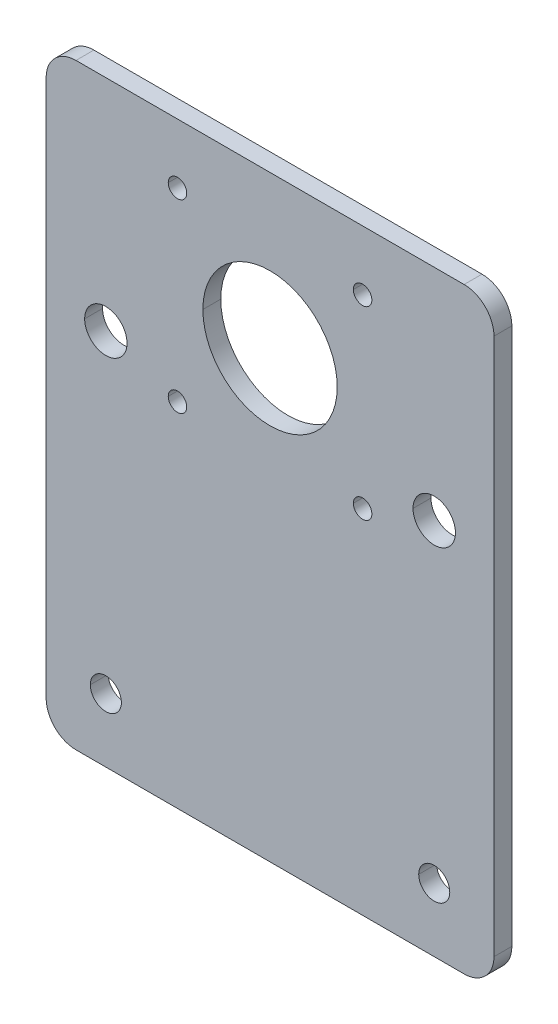
ISO-10303-21;
HEADER;
FILE_DESCRIPTION(('STEP AP214'),'2;1');
FILE_NAME('part.step','',(''),(''),'','','');
FILE_SCHEMA(('AUTOMOTIVE_DESIGN { 1 0 10303 214 1 1 1 1 }'));
ENDSEC;
DATA;
#1=APPLICATION_CONTEXT('core data for automotive mechanical design processes');
#2=APPLICATION_PROTOCOL_DEFINITION('international standard','automotive_design',2000,#1);
#3=PRODUCT_CONTEXT('',#1,'mechanical');
#4=PRODUCT('Part','Part','',(#3));
#5=PRODUCT_RELATED_PRODUCT_CATEGORY('part','',(#4));
#6=PRODUCT_DEFINITION_FORMATION('','',#4);
#7=PRODUCT_DEFINITION_CONTEXT('part definition',#1,'design');
#8=PRODUCT_DEFINITION('design','',#6,#7);
#9=PRODUCT_DEFINITION_SHAPE('','',#8);
#10=(LENGTH_UNIT() NAMED_UNIT(*) SI_UNIT(.MILLI.,.METRE.));
#11=(NAMED_UNIT(*) PLANE_ANGLE_UNIT() SI_UNIT($,.RADIAN.));
#12=(NAMED_UNIT(*) SI_UNIT($,.STERADIAN.) SOLID_ANGLE_UNIT());
#13=UNCERTAINTY_MEASURE_WITH_UNIT(LENGTH_MEASURE(1.E-05),#10,'distance_accuracy_value','');
#14=(GEOMETRIC_REPRESENTATION_CONTEXT(3) GLOBAL_UNCERTAINTY_ASSIGNED_CONTEXT((#13)) GLOBAL_UNIT_ASSIGNED_CONTEXT((#10,
#11,#12)) REPRESENTATION_CONTEXT('',''));
#15=CARTESIAN_POINT('',(0.,0.,0.));
#16=DIRECTION('',(0.,0.,1.));
#17=DIRECTION('',(1.,0.,0.));
#18=AXIS2_PLACEMENT_3D('',#15,#16,#17);
#19=CARTESIAN_POINT('',(40.,-75.7250966848653,3.));
#20=DIRECTION('',(0.,0.,-1.));
#21=DIRECTION('',(-1.,0.,0.));
#22=AXIS2_PLACEMENT_3D('',#19,#20,#21);
#23=CYLINDRICAL_SURFACE('',#22,5.);
#24=CARTESIAN_POINT('',(40.,-75.7250966848653,3.));
#25=DIRECTION('',(0.,0.,1.));
#26=DIRECTION('',(-1.,0.,0.));
#27=AXIS2_PLACEMENT_3D('',#24,#25,#26);
#28=CIRCLE('',#27,5.);
#29=CARTESIAN_POINT('',(40.,-80.7250966848653,3.));
#30=VERTEX_POINT('',#29);
#31=CARTESIAN_POINT('',(45.,-75.7250966848653,3.));
#32=VERTEX_POINT('',#31);
#33=EDGE_CURVE('E536',#30,#32,#28,.T.);
#34=ORIENTED_EDGE('',*,*,#33,.F.);
#35=DIRECTION('',(0.,0.,1.));
#36=VECTOR('',#35,1.);
#37=CARTESIAN_POINT('',(40.,-80.7250966848653,10.));
#38=LINE('',#37,#36);
#39=CARTESIAN_POINT('',(40.,-80.7250966848653,0.));
#40=VERTEX_POINT('',#39);
#41=EDGE_CURVE('E11',#40,#30,#38,.T.);
#42=ORIENTED_EDGE('',*,*,#41,.F.);
#43=CARTESIAN_POINT('',(40.,-75.7250966848653,0.));
#44=DIRECTION('',(0.,0.,-1.));
#45=DIRECTION('',(-1.,0.,0.));
#46=AXIS2_PLACEMENT_3D('',#43,#44,#45);
#47=CIRCLE('',#46,5.);
#48=CARTESIAN_POINT('',(45.,-75.7250966848653,0.));
#49=VERTEX_POINT('',#48);
#50=EDGE_CURVE('E424',#49,#40,#47,.T.);
#51=ORIENTED_EDGE('',*,*,#50,.F.);
#52=DIRECTION('',(0.,0.,-1.));
#53=VECTOR('',#52,1.);
#54=CARTESIAN_POINT('',(45.,-75.7250966848653,3.));
#55=LINE('',#54,#53);
#56=EDGE_CURVE('E451',#32,#49,#55,.T.);
#57=ORIENTED_EDGE('',*,*,#56,.F.);
#58=EDGE_LOOP('',(#34,#42,#51,#57));
#59=FACE_BOUND('',#58,.T.);
#60=ADVANCED_FACE('F17',(#59),#23,.T.);
#61=CARTESIAN_POINT('',(-25.,-75.7250966848653,10.));
#62=DIRECTION('',(0.,0.,-1.));
#63=DIRECTION('',(-1.,0.,0.));
#64=AXIS2_PLACEMENT_3D('',#61,#62,#63);
#65=CYLINDRICAL_SURFACE('',#64,5.);
#66=CARTESIAN_POINT('',(-25.,-75.7250966848653,3.));
#67=DIRECTION('',(0.,0.,1.));
#68=DIRECTION('',(-1.,0.,0.));
#69=AXIS2_PLACEMENT_3D('',#66,#67,#68);
#70=CIRCLE('',#69,5.);
#71=CARTESIAN_POINT('',(-30.,-75.7250966848653,3.));
#72=VERTEX_POINT('',#71);
#73=CARTESIAN_POINT('',(-25.,-80.7250966848653,3.));
#74=VERTEX_POINT('',#73);
#75=EDGE_CURVE('E528',#72,#74,#70,.T.);
#76=ORIENTED_EDGE('',*,*,#75,.F.);
#77=DIRECTION('',(0.,0.,1.));
#78=VECTOR('',#77,1.);
#79=CARTESIAN_POINT('',(-30.,-75.7250966848653,3.));
#80=LINE('',#79,#78);
#81=CARTESIAN_POINT('',(-30.,-75.7250966848653,0.));
#82=VERTEX_POINT('',#81);
#83=EDGE_CURVE('E347',#82,#72,#80,.T.);
#84=ORIENTED_EDGE('',*,*,#83,.F.);
#85=CARTESIAN_POINT('',(-25.,-75.7250966848653,0.));
#86=DIRECTION('',(0.,0.,-1.));
#87=DIRECTION('',(-1.,0.,0.));
#88=AXIS2_PLACEMENT_3D('',#85,#86,#87);
#89=CIRCLE('',#88,5.);
#90=CARTESIAN_POINT('',(-25.,-80.7250966848653,0.));
#91=VERTEX_POINT('',#90);
#92=EDGE_CURVE('E412',#91,#82,#89,.T.);
#93=ORIENTED_EDGE('',*,*,#92,.F.);
#94=DIRECTION('',(0.,0.,-1.));
#95=VECTOR('',#94,1.);
#96=CARTESIAN_POINT('',(-25.,-80.7250966848653,10.));
#97=LINE('',#96,#95);
#98=EDGE_CURVE('E25',#74,#91,#97,.T.);
#99=ORIENTED_EDGE('',*,*,#98,.F.);
#100=EDGE_LOOP('',(#76,#84,#93,#99));
#101=FACE_BOUND('',#100,.T.);
#102=ADVANCED_FACE('F543',(#101),#65,.T.);
#103=CARTESIAN_POINT('',(45.,-80.7250966848653,10.));
#104=DIRECTION('',(0.,1.,0.));
#105=DIRECTION('',(1.,0.,0.));
#106=AXIS2_PLACEMENT_3D('',#103,#104,#105);
#107=PLANE('',#106);
#108=DIRECTION('',(1.,0.,0.));
#109=VECTOR('',#108,1.);
#110=CARTESIAN_POINT('',(0.,-80.7250966848653,3.));
#111=LINE('',#110,#109);
#112=EDGE_CURVE('E532',#74,#30,#111,.T.);
#113=ORIENTED_EDGE('',*,*,#112,.F.);
#114=ORIENTED_EDGE('',*,*,#98,.T.);
#115=DIRECTION('',(1.,0.,0.));
#116=VECTOR('',#115,1.);
#117=CARTESIAN_POINT('',(45.,-80.7250966848653,0.));
#118=LINE('',#117,#116);
#119=EDGE_CURVE('E417',#91,#40,#118,.T.);
#120=ORIENTED_EDGE('',*,*,#119,.T.);
#121=ORIENTED_EDGE('',*,*,#41,.T.);
#122=EDGE_LOOP('',(#113,#114,#120,#121));
#123=FACE_BOUND('',#122,.T.);
#124=ADVANCED_FACE('F541',(#123),#107,.F.);
#125=CARTESIAN_POINT('',(0.,0.,3.));
#126=DIRECTION('',(0.,0.,-1.));
#127=DIRECTION('',(0.,-1.,0.));
#128=AXIS2_PLACEMENT_3D('',#125,#126,#127);
#129=PLANE('',#128);
#130=CARTESIAN_POINT('',(23.,9.27490331513474,3.));
#131=DIRECTION('',(0.,0.,-1.));
#132=DIRECTION('',(-1.,0.,0.));
#133=AXIS2_PLACEMENT_3D('',#130,#131,#132);
#134=CIRCLE('',#133,1.55);
#135=CARTESIAN_POINT('',(21.45,9.27490331513474,3.));
#136=VERTEX_POINT('',#135);
#137=CARTESIAN_POINT('',(24.55,9.27490331513474,3.));
#138=VERTEX_POINT('',#137);
#139=EDGE_CURVE('E525',#136,#138,#134,.T.);
#140=ORIENTED_EDGE('',*,*,#139,.T.);
#141=CARTESIAN_POINT('',(23.,9.27490331513474,3.));
#142=DIRECTION('',(0.,0.,-1.));
#143=DIRECTION('',(-1.,0.,0.));
#144=AXIS2_PLACEMENT_3D('',#141,#142,#143);
#145=CIRCLE('',#144,1.55);
#146=EDGE_CURVE('E336',#138,#136,#145,.T.);
#147=ORIENTED_EDGE('',*,*,#146,.T.);
#148=EDGE_LOOP('',(#140,#147));
#149=FACE_BOUND('',#148,.T.);
#150=CARTESIAN_POINT('',(-8.,-21.7250966848652,3.));
#151=DIRECTION('',(0.,0.,-1.));
#152=DIRECTION('',(-1.,0.,0.));
#153=AXIS2_PLACEMENT_3D('',#150,#151,#152);
#154=CIRCLE('',#153,1.55);
#155=CARTESIAN_POINT('',(-9.55,-21.7250966848652,3.));
#156=VERTEX_POINT('',#155);
#157=CARTESIAN_POINT('',(-6.45,-21.7250966848652,3.));
#158=VERTEX_POINT('',#157);
#159=EDGE_CURVE('E489',#156,#158,#154,.T.);
#160=ORIENTED_EDGE('',*,*,#159,.T.);
#161=CARTESIAN_POINT('',(-8.,-21.7250966848652,3.));
#162=DIRECTION('',(0.,0.,-1.));
#163=DIRECTION('',(-1.,0.,0.));
#164=AXIS2_PLACEMENT_3D('',#161,#162,#163);
#165=CIRCLE('',#164,1.55);
#166=EDGE_CURVE('E395',#158,#156,#165,.T.);
#167=ORIENTED_EDGE('',*,*,#166,.T.);
#168=EDGE_LOOP('',(#160,#167));
#169=FACE_BOUND('',#168,.T.);
#170=CARTESIAN_POINT('',(35.,-17.4750966848652,3.));
#171=DIRECTION('',(0.,0.,-1.));
#172=DIRECTION('',(-1.,0.,0.));
#173=AXIS2_PLACEMENT_3D('',#170,#171,#172);
#174=CIRCLE('',#173,3.55);
#175=CARTESIAN_POINT('',(31.45,-17.4750966848652,3.));
#176=VERTEX_POINT('',#175);
#177=CARTESIAN_POINT('',(38.55,-17.4750966848652,3.));
#178=VERTEX_POINT('',#177);
#179=EDGE_CURVE('E486',#176,#178,#174,.T.);
#180=ORIENTED_EDGE('',*,*,#179,.T.);
#181=CARTESIAN_POINT('',(35.,-17.4750966848652,3.));
#182=DIRECTION('',(0.,0.,-1.));
#183=DIRECTION('',(-1.,0.,0.));
#184=AXIS2_PLACEMENT_3D('',#181,#182,#183);
#185=CIRCLE('',#184,3.55);
#186=EDGE_CURVE('E311',#178,#176,#185,.T.);
#187=ORIENTED_EDGE('',*,*,#186,.T.);
#188=EDGE_LOOP('',(#180,#187));
#189=FACE_BOUND('',#188,.T.);
#190=CARTESIAN_POINT('',(35.,-70.0750966848653,3.));
#191=DIRECTION('',(0.,0.,-1.));
#192=DIRECTION('',(-1.,0.,0.));
#193=AXIS2_PLACEMENT_3D('',#190,#191,#192);
#194=CIRCLE('',#193,2.6);
#195=CARTESIAN_POINT('',(32.4,-70.0750966848653,3.));
#196=VERTEX_POINT('',#195);
#197=CARTESIAN_POINT('',(37.6,-70.0750966848653,3.));
#198=VERTEX_POINT('',#197);
#199=EDGE_CURVE('E490',#196,#198,#194,.T.);
#200=ORIENTED_EDGE('',*,*,#199,.T.);
#201=CARTESIAN_POINT('',(35.,-70.0750966848653,3.));
#202=DIRECTION('',(0.,0.,-1.));
#203=DIRECTION('',(-1.,0.,0.));
#204=AXIS2_PLACEMENT_3D('',#201,#202,#203);
#205=CIRCLE('',#204,2.6);
#206=EDGE_CURVE('E369',#198,#196,#205,.T.);
#207=ORIENTED_EDGE('',*,*,#206,.T.);
#208=EDGE_LOOP('',(#200,#207));
#209=FACE_BOUND('',#208,.T.);
#210=CARTESIAN_POINT('',(-20.,-70.0750966848653,3.));
#211=DIRECTION('',(0.,0.,-1.));
#212=DIRECTION('',(-1.,0.,0.));
#213=AXIS2_PLACEMENT_3D('',#210,#211,#212);
#214=CIRCLE('',#213,2.6);
#215=CARTESIAN_POINT('',(-22.6,-70.0750966848653,3.));
#216=VERTEX_POINT('',#215);
#217=CARTESIAN_POINT('',(-17.4,-70.0750966848653,3.));
#218=VERTEX_POINT('',#217);
#219=EDGE_CURVE('E503',#216,#218,#214,.T.);
#220=ORIENTED_EDGE('',*,*,#219,.T.);
#221=CARTESIAN_POINT('',(-20.,-70.0750966848653,3.));
#222=DIRECTION('',(0.,0.,-1.));
#223=DIRECTION('',(-1.,0.,0.));
#224=AXIS2_PLACEMENT_3D('',#221,#222,#223);
#225=CIRCLE('',#224,2.6);
#226=EDGE_CURVE('E298',#218,#216,#225,.T.);
#227=ORIENTED_EDGE('',*,*,#226,.T.);
#228=EDGE_LOOP('',(#220,#227));
#229=FACE_BOUND('',#228,.T.);
#230=CARTESIAN_POINT('',(-20.,-17.4750966848652,3.));
#231=DIRECTION('',(0.,0.,-1.));
#232=DIRECTION('',(-1.,0.,0.));
#233=AXIS2_PLACEMENT_3D('',#230,#231,#232);
#234=CIRCLE('',#233,3.55);
#235=CARTESIAN_POINT('',(-23.55,-17.4750966848652,3.));
#236=VERTEX_POINT('',#235);
#237=CARTESIAN_POINT('',(-16.45,-17.4750966848652,3.));
#238=VERTEX_POINT('',#237);
#239=EDGE_CURVE('E459',#236,#238,#234,.T.);
#240=ORIENTED_EDGE('',*,*,#239,.T.);
#241=CARTESIAN_POINT('',(-20.,-17.4750966848652,3.));
#242=DIRECTION('',(0.,0.,-1.));
#243=DIRECTION('',(-1.,0.,0.));
#244=AXIS2_PLACEMENT_3D('',#241,#242,#243);
#245=CIRCLE('',#244,3.55);
#246=EDGE_CURVE('E306',#238,#236,#245,.T.);
#247=ORIENTED_EDGE('',*,*,#246,.T.);
#248=EDGE_LOOP('',(#240,#247));
#249=FACE_BOUND('',#248,.T.);
#250=CARTESIAN_POINT('',(-8.,9.27490331513474,3.));
#251=DIRECTION('',(0.,0.,-1.));
#252=DIRECTION('',(-1.,0.,0.));
#253=AXIS2_PLACEMENT_3D('',#250,#251,#252);
#254=CIRCLE('',#253,1.55);
#255=CARTESIAN_POINT('',(-9.55,9.27490331513474,3.));
#256=VERTEX_POINT('',#255);
#257=CARTESIAN_POINT('',(-6.45,9.27490331513474,3.));
#258=VERTEX_POINT('',#257);
#259=EDGE_CURVE('E456',#256,#258,#254,.T.);
#260=ORIENTED_EDGE('',*,*,#259,.T.);
#261=CARTESIAN_POINT('',(-8.,9.27490331513474,3.));
#262=DIRECTION('',(0.,0.,-1.));
#263=DIRECTION('',(-1.,0.,0.));
#264=AXIS2_PLACEMENT_3D('',#261,#262,#263);
#265=CIRCLE('',#264,1.55);
#266=EDGE_CURVE('E327',#258,#256,#265,.T.);
#267=ORIENTED_EDGE('',*,*,#266,.T.);
#268=EDGE_LOOP('',(#260,#267));
#269=FACE_BOUND('',#268,.T.);
#270=CARTESIAN_POINT('',(23.,-21.7250966848652,3.));
#271=DIRECTION('',(0.,0.,-1.));
#272=DIRECTION('',(-1.,0.,0.));
#273=AXIS2_PLACEMENT_3D('',#270,#271,#272);
#274=CIRCLE('',#273,1.55);
#275=CARTESIAN_POINT('',(21.45,-21.7250966848652,3.));
#276=VERTEX_POINT('',#275);
#277=CARTESIAN_POINT('',(24.55,-21.7250966848652,3.));
#278=VERTEX_POINT('',#277);
#279=EDGE_CURVE('E257',#276,#278,#274,.T.);
#280=ORIENTED_EDGE('',*,*,#279,.T.);
#281=CARTESIAN_POINT('',(23.,-21.7250966848652,3.));
#282=DIRECTION('',(0.,0.,-1.));
#283=DIRECTION('',(-1.,0.,0.));
#284=AXIS2_PLACEMENT_3D('',#281,#282,#283);
#285=CIRCLE('',#284,1.55);
#286=EDGE_CURVE('E294',#278,#276,#285,.T.);
#287=ORIENTED_EDGE('',*,*,#286,.T.);
#288=EDGE_LOOP('',(#280,#287));
#289=FACE_BOUND('',#288,.T.);
#290=CARTESIAN_POINT('',(7.5,-6.22509668486526,3.));
#291=DIRECTION('',(0.,0.,-1.));
#292=DIRECTION('',(-1.,0.,0.));
#293=AXIS2_PLACEMENT_3D('',#290,#291,#292);
#294=CIRCLE('',#293,11.25);
#295=CARTESIAN_POINT('',(-3.75,-6.22509668486526,3.));
#296=VERTEX_POINT('',#295);
#297=CARTESIAN_POINT('',(18.75,-6.22509668486526,3.));
#298=VERTEX_POINT('',#297);
#299=EDGE_CURVE('E247',#296,#298,#294,.T.);
#300=ORIENTED_EDGE('',*,*,#299,.T.);
#301=CARTESIAN_POINT('',(7.5,-6.22509668486526,3.));
#302=DIRECTION('',(0.,0.,-1.));
#303=DIRECTION('',(-1.,0.,0.));
#304=AXIS2_PLACEMENT_3D('',#301,#302,#303);
#305=CIRCLE('',#304,11.25);
#306=EDGE_CURVE('E252',#298,#296,#305,.T.);
#307=ORIENTED_EDGE('',*,*,#306,.T.);
#308=EDGE_LOOP('',(#300,#307));
#309=FACE_BOUND('',#308,.T.);
#310=DIRECTION('',(0.,-1.,0.));
#311=VECTOR('',#310,1.);
#312=CARTESIAN_POINT('',(-30.,-105.819408872504,3.));
#313=LINE('',#312,#311);
#314=CARTESIAN_POINT('',(-30.,14.2749033151347,3.));
#315=VERTEX_POINT('',#314);
#316=EDGE_CURVE('E351',#315,#72,#313,.T.);
#317=ORIENTED_EDGE('',*,*,#316,.T.);
#318=ORIENTED_EDGE('',*,*,#75,.T.);
#319=ORIENTED_EDGE('',*,*,#112,.T.);
#320=ORIENTED_EDGE('',*,*,#33,.T.);
#321=DIRECTION('',(0.,1.,0.));
#322=VECTOR('',#321,1.);
#323=CARTESIAN_POINT('',(45.,-105.819408872504,3.));
#324=LINE('',#323,#322);
#325=CARTESIAN_POINT('',(45.,14.2749033151347,3.));
#326=VERTEX_POINT('',#325);
#327=EDGE_CURVE('E399',#32,#326,#324,.T.);
#328=ORIENTED_EDGE('',*,*,#327,.T.);
#329=CARTESIAN_POINT('',(40.,14.2749033151347,3.));
#330=DIRECTION('',(0.,0.,-1.));
#331=DIRECTION('',(-1.,0.,0.));
#332=AXIS2_PLACEMENT_3D('',#329,#330,#331);
#333=CIRCLE('',#332,5.);
#334=CARTESIAN_POINT('',(40.,19.2749033151348,3.));
#335=VERTEX_POINT('',#334);
#336=EDGE_CURVE('E512',#335,#326,#333,.T.);
#337=ORIENTED_EDGE('',*,*,#336,.F.);
#338=DIRECTION('',(-1.,0.,0.));
#339=VECTOR('',#338,1.);
#340=CARTESIAN_POINT('',(-30.,19.2749033151348,3.));
#341=LINE('',#340,#339);
#342=CARTESIAN_POINT('',(-25.,19.2749033151348,3.));
#343=VERTEX_POINT('',#342);
#344=EDGE_CURVE('E361',#335,#343,#341,.T.);
#345=ORIENTED_EDGE('',*,*,#344,.T.);
#346=CARTESIAN_POINT('',(-25.,14.2749033151347,3.));
#347=DIRECTION('',(0.,0.,-1.));
#348=DIRECTION('',(-1.,0.,0.));
#349=AXIS2_PLACEMENT_3D('',#346,#347,#348);
#350=CIRCLE('',#349,5.);
#351=EDGE_CURVE('E352',#315,#343,#350,.T.);
#352=ORIENTED_EDGE('',*,*,#351,.F.);
#353=EDGE_LOOP('',(#317,#318,#319,#320,#328,#337,#345,#352));
#354=FACE_BOUND('',#353,.T.);
#355=ADVANCED_FACE('F249',(#149,#169,#189,#209,#229,#249,#269,#289,#309,#354),#129,.F.);
#356=CARTESIAN_POINT('',(23.,9.27490331513474,3.));
#357=DIRECTION('',(0.,0.,-1.));
#358=DIRECTION('',(-1.,0.,0.));
#359=AXIS2_PLACEMENT_3D('',#356,#357,#358);
#360=CYLINDRICAL_SURFACE('',#359,1.55);
#361=DIRECTION('',(0.,0.,-1.));
#362=VECTOR('',#361,1.);
#363=CARTESIAN_POINT('',(24.55,9.27490331513474,3.));
#364=LINE('',#363,#362);
#365=CARTESIAN_POINT('',(24.55,9.27490331513474,0.));
#366=VERTEX_POINT('',#365);
#367=EDGE_CURVE('E331',#138,#366,#364,.T.);
#368=ORIENTED_EDGE('',*,*,#367,.F.);
#369=ORIENTED_EDGE('',*,*,#139,.F.);
#370=DIRECTION('',(0.,0.,-1.));
#371=VECTOR('',#370,1.);
#372=CARTESIAN_POINT('',(21.45,9.27490331513474,3.));
#373=LINE('',#372,#371);
#374=CARTESIAN_POINT('',(21.45,9.27490331513474,0.));
#375=VERTEX_POINT('',#374);
#376=EDGE_CURVE('E435',#136,#375,#373,.T.);
#377=ORIENTED_EDGE('',*,*,#376,.T.);
#378=CARTESIAN_POINT('',(23.,9.27490331513474,0.));
#379=DIRECTION('',(0.,0.,1.));
#380=DIRECTION('',(-1.,0.,0.));
#381=AXIS2_PLACEMENT_3D('',#378,#379,#380);
#382=CIRCLE('',#381,1.55);
#383=EDGE_CURVE('E258',#366,#375,#382,.T.);
#384=ORIENTED_EDGE('',*,*,#383,.F.);
#385=EDGE_LOOP('',(#368,#369,#377,#384));
#386=FACE_BOUND('',#385,.T.);
#387=ADVANCED_FACE('F593',(#386),#360,.F.);
#388=CARTESIAN_POINT('',(-8.,-21.7250966848652,3.));
#389=DIRECTION('',(0.,0.,-1.));
#390=DIRECTION('',(-1.,0.,0.));
#391=AXIS2_PLACEMENT_3D('',#388,#389,#390);
#392=CYLINDRICAL_SURFACE('',#391,1.55);
#393=DIRECTION('',(0.,0.,-1.));
#394=VECTOR('',#393,1.);
#395=CARTESIAN_POINT('',(-6.45,-21.7250966848652,3.));
#396=LINE('',#395,#394);
#397=CARTESIAN_POINT('',(-6.45,-21.7250966848652,0.));
#398=VERTEX_POINT('',#397);
#399=EDGE_CURVE('E403',#158,#398,#396,.T.);
#400=ORIENTED_EDGE('',*,*,#399,.F.);
#401=ORIENTED_EDGE('',*,*,#159,.F.);
#402=DIRECTION('',(0.,0.,-1.));
#403=VECTOR('',#402,1.);
#404=CARTESIAN_POINT('',(-9.55,-21.7250966848652,3.));
#405=LINE('',#404,#403);
#406=CARTESIAN_POINT('',(-9.55,-21.7250966848652,0.));
#407=VERTEX_POINT('',#406);
#408=EDGE_CURVE('E411',#156,#407,#405,.T.);
#409=ORIENTED_EDGE('',*,*,#408,.T.);
#410=CARTESIAN_POINT('',(-8.,-21.7250966848652,0.));
#411=DIRECTION('',(0.,0.,1.));
#412=DIRECTION('',(-1.,0.,0.));
#413=AXIS2_PLACEMENT_3D('',#410,#411,#412);
#414=CIRCLE('',#413,1.55);
#415=EDGE_CURVE('E439',#398,#407,#414,.T.);
#416=ORIENTED_EDGE('',*,*,#415,.F.);
#417=EDGE_LOOP('',(#400,#401,#409,#416));
#418=FACE_BOUND('',#417,.T.);
#419=ADVANCED_FACE('F597',(#418),#392,.F.);
#420=CARTESIAN_POINT('',(35.,-17.4750966848652,3.));
#421=DIRECTION('',(0.,0.,-1.));
#422=DIRECTION('',(-1.,0.,0.));
#423=AXIS2_PLACEMENT_3D('',#420,#421,#422);
#424=CYLINDRICAL_SURFACE('',#423,3.55);
#425=DIRECTION('',(0.,0.,-1.));
#426=VECTOR('',#425,1.);
#427=CARTESIAN_POINT('',(38.55,-17.4750966848652,3.));
#428=LINE('',#427,#426);
#429=CARTESIAN_POINT('',(38.55,-17.4750966848652,0.));
#430=VERTEX_POINT('',#429);
#431=EDGE_CURVE('E383',#178,#430,#428,.T.);
#432=ORIENTED_EDGE('',*,*,#431,.F.);
#433=ORIENTED_EDGE('',*,*,#179,.F.);
#434=DIRECTION('',(0.,0.,-1.));
#435=VECTOR('',#434,1.);
#436=CARTESIAN_POINT('',(31.45,-17.4750966848652,3.));
#437=LINE('',#436,#435);
#438=CARTESIAN_POINT('',(31.45,-17.4750966848652,0.));
#439=VERTEX_POINT('',#438);
#440=EDGE_CURVE('E391',#176,#439,#437,.T.);
#441=ORIENTED_EDGE('',*,*,#440,.T.);
#442=CARTESIAN_POINT('',(35.,-17.4750966848652,0.));
#443=DIRECTION('',(0.,0.,1.));
#444=DIRECTION('',(-1.,0.,0.));
#445=AXIS2_PLACEMENT_3D('',#442,#443,#444);
#446=CIRCLE('',#445,3.55);
#447=EDGE_CURVE('E442',#430,#439,#446,.T.);
#448=ORIENTED_EDGE('',*,*,#447,.F.);
#449=EDGE_LOOP('',(#432,#433,#441,#448));
#450=FACE_BOUND('',#449,.T.);
#451=ADVANCED_FACE('F578',(#450),#424,.F.);
#452=CARTESIAN_POINT('',(35.,-70.0750966848653,3.));
#453=DIRECTION('',(0.,0.,-1.));
#454=DIRECTION('',(-1.,0.,0.));
#455=AXIS2_PLACEMENT_3D('',#452,#453,#454);
#456=CYLINDRICAL_SURFACE('',#455,2.6);
#457=DIRECTION('',(0.,0.,-1.));
#458=VECTOR('',#457,1.);
#459=CARTESIAN_POINT('',(37.6,-70.0750966848653,3.));
#460=LINE('',#459,#458);
#461=CARTESIAN_POINT('',(37.6,-70.0750966848653,0.));
#462=VERTEX_POINT('',#461);
#463=EDGE_CURVE('E373',#198,#462,#460,.T.);
#464=ORIENTED_EDGE('',*,*,#463,.F.);
#465=ORIENTED_EDGE('',*,*,#199,.F.);
#466=DIRECTION('',(0.,0.,-1.));
#467=VECTOR('',#466,1.);
#468=CARTESIAN_POINT('',(32.4,-70.0750966848653,3.));
#469=LINE('',#468,#467);
#470=CARTESIAN_POINT('',(32.4,-70.0750966848653,0.));
#471=VERTEX_POINT('',#470);
#472=EDGE_CURVE('E307',#196,#471,#469,.T.);
#473=ORIENTED_EDGE('',*,*,#472,.T.);
#474=CARTESIAN_POINT('',(35.,-70.0750966848653,0.));
#475=DIRECTION('',(0.,0.,1.));
#476=DIRECTION('',(-1.,0.,0.));
#477=AXIS2_PLACEMENT_3D('',#474,#475,#476);
#478=CIRCLE('',#477,2.6);
#479=EDGE_CURVE('E485',#462,#471,#478,.T.);
#480=ORIENTED_EDGE('',*,*,#479,.F.);
#481=EDGE_LOOP('',(#464,#465,#473,#480));
#482=FACE_BOUND('',#481,.T.);
#483=ADVANCED_FACE('F570',(#482),#456,.F.);
#484=CARTESIAN_POINT('',(45.,-105.819408872504,3.));
#485=DIRECTION('',(-1.,0.,0.));
#486=DIRECTION('',(0.,0.,1.));
#487=AXIS2_PLACEMENT_3D('',#484,#485,#486);
#488=PLANE('',#487);
#489=ORIENTED_EDGE('',*,*,#327,.F.);
#490=ORIENTED_EDGE('',*,*,#56,.T.);
#491=DIRECTION('',(0.,-1.,0.));
#492=VECTOR('',#491,1.);
#493=CARTESIAN_POINT('',(45.,0.,0.));
#494=LINE('',#493,#492);
#495=CARTESIAN_POINT('',(45.,14.2749033151347,0.));
#496=VERTEX_POINT('',#495);
#497=EDGE_CURVE('E467',#496,#49,#494,.T.);
#498=ORIENTED_EDGE('',*,*,#497,.F.);
#499=DIRECTION('',(0.,0.,-1.));
#500=VECTOR('',#499,1.);
#501=CARTESIAN_POINT('',(45.,14.2749033151347,3.));
#502=LINE('',#501,#500);
#503=EDGE_CURVE('E431',#326,#496,#502,.T.);
#504=ORIENTED_EDGE('',*,*,#503,.F.);
#505=EDGE_LOOP('',(#489,#490,#498,#504));
#506=FACE_BOUND('',#505,.T.);
#507=ADVANCED_FACE('F568',(#506),#488,.F.);
#508=CARTESIAN_POINT('',(-30.,-105.819408872504,3.));
#509=DIRECTION('',(1.,0.,0.));
#510=DIRECTION('',(0.,1.,0.));
#511=AXIS2_PLACEMENT_3D('',#508,#509,#510);
#512=PLANE('',#511);
#513=DIRECTION('',(0.,1.,0.));
#514=VECTOR('',#513,1.);
#515=CARTESIAN_POINT('',(-30.,0.,0.));
#516=LINE('',#515,#514);
#517=CARTESIAN_POINT('',(-30.,14.2749033151347,0.));
#518=VERTEX_POINT('',#517);
#519=EDGE_CURVE('E416',#82,#518,#516,.T.);
#520=ORIENTED_EDGE('',*,*,#519,.F.);
#521=ORIENTED_EDGE('',*,*,#83,.T.);
#522=ORIENTED_EDGE('',*,*,#316,.F.);
#523=DIRECTION('',(0.,0.,1.));
#524=VECTOR('',#523,1.);
#525=CARTESIAN_POINT('',(-30.,14.2749033151347,3.));
#526=LINE('',#525,#524);
#527=EDGE_CURVE('E357',#518,#315,#526,.T.);
#528=ORIENTED_EDGE('',*,*,#527,.F.);
#529=EDGE_LOOP('',(#520,#521,#522,#528));
#530=FACE_BOUND('',#529,.T.);
#531=ADVANCED_FACE('F554',(#530),#512,.F.);
#532=CARTESIAN_POINT('',(-25.,14.2749033151347,3.));
#533=DIRECTION('',(0.,0.,-1.));
#534=DIRECTION('',(-1.,0.,0.));
#535=AXIS2_PLACEMENT_3D('',#532,#533,#534);
#536=CYLINDRICAL_SURFACE('',#535,5.);
#537=CARTESIAN_POINT('',(-25.,14.2749033151347,0.));
#538=DIRECTION('',(0.,0.,-1.));
#539=DIRECTION('',(-1.,0.,0.));
#540=AXIS2_PLACEMENT_3D('',#537,#538,#539);
#541=CIRCLE('',#540,5.);
#542=CARTESIAN_POINT('',(-25.,19.2749033151348,0.));
#543=VERTEX_POINT('',#542);
#544=EDGE_CURVE('E448',#518,#543,#541,.T.);
#545=ORIENTED_EDGE('',*,*,#544,.F.);
#546=ORIENTED_EDGE('',*,*,#527,.T.);
#547=ORIENTED_EDGE('',*,*,#351,.T.);
#548=DIRECTION('',(0.,0.,-1.));
#549=VECTOR('',#548,1.);
#550=CARTESIAN_POINT('',(-25.,19.2749033151348,3.));
#551=LINE('',#550,#549);
#552=EDGE_CURVE('E428',#343,#543,#551,.T.);
#553=ORIENTED_EDGE('',*,*,#552,.T.);
#554=EDGE_LOOP('',(#545,#546,#547,#553));
#555=FACE_BOUND('',#554,.T.);
#556=ADVANCED_FACE('F558',(#555),#536,.T.);
#557=CARTESIAN_POINT('',(-30.,19.2749033151348,3.));
#558=DIRECTION('',(0.,-1.,0.));
#559=DIRECTION('',(0.,0.,-1.));
#560=AXIS2_PLACEMENT_3D('',#557,#558,#559);
#561=PLANE('',#560);
#562=DIRECTION('',(0.,0.,1.));
#563=VECTOR('',#562,1.);
#564=CARTESIAN_POINT('',(40.,19.2749033151348,3.));
#565=LINE('',#564,#563);
#566=CARTESIAN_POINT('',(40.,19.2749033151348,0.));
#567=VERTEX_POINT('',#566);
#568=EDGE_CURVE('E508',#567,#335,#565,.T.);
#569=ORIENTED_EDGE('',*,*,#568,.F.);
#570=DIRECTION('',(1.,0.,0.));
#571=VECTOR('',#570,1.);
#572=CARTESIAN_POINT('',(0.,19.2749033151348,0.));
#573=LINE('',#572,#571);
#574=EDGE_CURVE('E455',#543,#567,#573,.T.);
#575=ORIENTED_EDGE('',*,*,#574,.F.);
#576=ORIENTED_EDGE('',*,*,#552,.F.);
#577=ORIENTED_EDGE('',*,*,#344,.F.);
#578=EDGE_LOOP('',(#569,#575,#576,#577));
#579=FACE_BOUND('',#578,.T.);
#580=ADVANCED_FACE('F561',(#579),#561,.F.);
#581=CARTESIAN_POINT('',(40.,14.2749033151347,3.));
#582=DIRECTION('',(0.,0.,-1.));
#583=DIRECTION('',(-1.,0.,0.));
#584=AXIS2_PLACEMENT_3D('',#581,#582,#583);
#585=CYLINDRICAL_SURFACE('',#584,5.);
#586=CARTESIAN_POINT('',(40.,14.2749033151347,0.));
#587=DIRECTION('',(0.,0.,-1.));
#588=DIRECTION('',(-1.,0.,0.));
#589=AXIS2_PLACEMENT_3D('',#586,#587,#588);
#590=CIRCLE('',#589,5.);
#591=EDGE_CURVE('E463',#567,#496,#590,.T.);
#592=ORIENTED_EDGE('',*,*,#591,.F.);
#593=ORIENTED_EDGE('',*,*,#568,.T.);
#594=ORIENTED_EDGE('',*,*,#336,.T.);
#595=ORIENTED_EDGE('',*,*,#503,.T.);
#596=EDGE_LOOP('',(#592,#593,#594,#595));
#597=FACE_BOUND('',#596,.T.);
#598=ADVANCED_FACE('F565',(#597),#585,.T.);
#599=CARTESIAN_POINT('',(-20.,-70.0750966848653,3.));
#600=DIRECTION('',(0.,0.,-1.));
#601=DIRECTION('',(-1.,0.,0.));
#602=AXIS2_PLACEMENT_3D('',#599,#600,#601);
#603=CYLINDRICAL_SURFACE('',#602,2.6);
#604=DIRECTION('',(0.,0.,-1.));
#605=VECTOR('',#604,1.);
#606=CARTESIAN_POINT('',(-17.4,-70.0750966848653,3.));
#607=LINE('',#606,#605);
#608=CARTESIAN_POINT('',(-17.4,-70.0750966848653,0.));
#609=VERTEX_POINT('',#608);
#610=EDGE_CURVE('E346',#218,#609,#607,.T.);
#611=ORIENTED_EDGE('',*,*,#610,.F.);
#612=ORIENTED_EDGE('',*,*,#219,.F.);
#613=DIRECTION('',(0.,0.,-1.));
#614=VECTOR('',#613,1.);
#615=CARTESIAN_POINT('',(-22.6,-70.0750966848653,3.));
#616=LINE('',#615,#614);
#617=CARTESIAN_POINT('',(-22.6,-70.0750966848653,0.));
#618=VERTEX_POINT('',#617);
#619=EDGE_CURVE('E365',#216,#618,#616,.T.);
#620=ORIENTED_EDGE('',*,*,#619,.T.);
#621=CARTESIAN_POINT('',(-20.,-70.0750966848653,0.));
#622=DIRECTION('',(0.,0.,1.));
#623=DIRECTION('',(-1.,0.,0.));
#624=AXIS2_PLACEMENT_3D('',#621,#622,#623);
#625=CIRCLE('',#624,2.6);
#626=EDGE_CURVE('E482',#609,#618,#625,.T.);
#627=ORIENTED_EDGE('',*,*,#626,.F.);
#628=EDGE_LOOP('',(#611,#612,#620,#627));
#629=FACE_BOUND('',#628,.T.);
#630=ADVANCED_FACE('F654',(#629),#603,.F.);
#631=CARTESIAN_POINT('',(-20.,-17.4750966848652,3.));
#632=DIRECTION('',(0.,0.,-1.));
#633=DIRECTION('',(-1.,0.,0.));
#634=AXIS2_PLACEMENT_3D('',#631,#632,#633);
#635=CYLINDRICAL_SURFACE('',#634,3.55);
#636=DIRECTION('',(0.,0.,-1.));
#637=VECTOR('',#636,1.);
#638=CARTESIAN_POINT('',(-16.45,-17.4750966848652,3.));
#639=LINE('',#638,#637);
#640=CARTESIAN_POINT('',(-16.45,-17.4750966848652,0.));
#641=VERTEX_POINT('',#640);
#642=EDGE_CURVE('E283',#238,#641,#639,.T.);
#643=ORIENTED_EDGE('',*,*,#642,.F.);
#644=ORIENTED_EDGE('',*,*,#239,.F.);
#645=DIRECTION('',(0.,0.,-1.));
#646=VECTOR('',#645,1.);
#647=CARTESIAN_POINT('',(-23.55,-17.4750966848652,3.));
#648=LINE('',#647,#646);
#649=CARTESIAN_POINT('',(-23.55,-17.4750966848652,0.));
#650=VERTEX_POINT('',#649);
#651=EDGE_CURVE('E282',#236,#650,#648,.T.);
#652=ORIENTED_EDGE('',*,*,#651,.T.);
#653=CARTESIAN_POINT('',(-20.,-17.4750966848652,0.));
#654=DIRECTION('',(0.,0.,1.));
#655=DIRECTION('',(-1.,0.,0.));
#656=AXIS2_PLACEMENT_3D('',#653,#654,#655);
#657=CIRCLE('',#656,3.55);
#658=EDGE_CURVE('E479',#641,#650,#657,.T.);
#659=ORIENTED_EDGE('',*,*,#658,.F.);
#660=EDGE_LOOP('',(#643,#644,#652,#659));
#661=FACE_BOUND('',#660,.T.);
#662=ADVANCED_FACE('F650',(#661),#635,.F.);
#663=CARTESIAN_POINT('',(-8.,9.27490331513474,3.));
#664=DIRECTION('',(0.,0.,-1.));
#665=DIRECTION('',(-1.,0.,0.));
#666=AXIS2_PLACEMENT_3D('',#663,#664,#665);
#667=CYLINDRICAL_SURFACE('',#666,1.55);
#668=DIRECTION('',(0.,0.,-1.));
#669=VECTOR('',#668,1.);
#670=CARTESIAN_POINT('',(-6.45,9.27490331513474,3.));
#671=LINE('',#670,#669);
#672=CARTESIAN_POINT('',(-6.45,9.27490331513474,0.));
#673=VERTEX_POINT('',#672);
#674=EDGE_CURVE('E291',#258,#673,#671,.T.);
#675=ORIENTED_EDGE('',*,*,#674,.F.);
#676=ORIENTED_EDGE('',*,*,#259,.F.);
#677=DIRECTION('',(0.,0.,-1.));
#678=VECTOR('',#677,1.);
#679=CARTESIAN_POINT('',(-9.55,9.27490331513474,3.));
#680=LINE('',#679,#678);
#681=CARTESIAN_POINT('',(-9.55,9.27490331513474,0.));
#682=VERTEX_POINT('',#681);
#683=EDGE_CURVE('E290',#256,#682,#680,.T.);
#684=ORIENTED_EDGE('',*,*,#683,.T.);
#685=CARTESIAN_POINT('',(-8.,9.27490331513474,0.));
#686=DIRECTION('',(0.,0.,1.));
#687=DIRECTION('',(-1.,0.,0.));
#688=AXIS2_PLACEMENT_3D('',#685,#686,#687);
#689=CIRCLE('',#688,1.55);
#690=EDGE_CURVE('E476',#673,#682,#689,.T.);
#691=ORIENTED_EDGE('',*,*,#690,.F.);
#692=EDGE_LOOP('',(#675,#676,#684,#691));
#693=FACE_BOUND('',#692,.T.);
#694=ADVANCED_FACE('F647',(#693),#667,.F.);
#695=CARTESIAN_POINT('',(23.,-21.7250966848652,3.));
#696=DIRECTION('',(0.,0.,-1.));
#697=DIRECTION('',(-1.,0.,0.));
#698=AXIS2_PLACEMENT_3D('',#695,#696,#697);
#699=CYLINDRICAL_SURFACE('',#698,1.55);
#700=DIRECTION('',(0.,0.,-1.));
#701=VECTOR('',#700,1.);
#702=CARTESIAN_POINT('',(24.55,-21.7250966848652,3.));
#703=LINE('',#702,#701);
#704=CARTESIAN_POINT('',(24.55,-21.7250966848652,0.));
#705=VERTEX_POINT('',#704);
#706=EDGE_CURVE('E302',#278,#705,#703,.T.);
#707=ORIENTED_EDGE('',*,*,#706,.F.);
#708=ORIENTED_EDGE('',*,*,#279,.F.);
#709=DIRECTION('',(0.,0.,-1.));
#710=VECTOR('',#709,1.);
#711=CARTESIAN_POINT('',(21.45,-21.7250966848652,3.));
#712=LINE('',#711,#710);
#713=CARTESIAN_POINT('',(21.45,-21.7250966848652,0.));
#714=VERTEX_POINT('',#713);
#715=EDGE_CURVE('E323',#276,#714,#712,.T.);
#716=ORIENTED_EDGE('',*,*,#715,.T.);
#717=CARTESIAN_POINT('',(23.,-21.7250966848652,0.));
#718=DIRECTION('',(0.,0.,1.));
#719=DIRECTION('',(-1.,0.,0.));
#720=AXIS2_PLACEMENT_3D('',#717,#718,#719);
#721=CIRCLE('',#720,1.55);
#722=EDGE_CURVE('E423',#705,#714,#721,.T.);
#723=ORIENTED_EDGE('',*,*,#722,.F.);
#724=EDGE_LOOP('',(#707,#708,#716,#723));
#725=FACE_BOUND('',#724,.T.);
#726=ADVANCED_FACE('F625',(#725),#699,.F.);
#727=CARTESIAN_POINT('',(7.5,-6.22509668486526,3.));
#728=DIRECTION('',(0.,0.,-1.));
#729=DIRECTION('',(-1.,0.,0.));
#730=AXIS2_PLACEMENT_3D('',#727,#728,#729);
#731=CYLINDRICAL_SURFACE('',#730,11.25);
#732=DIRECTION('',(0.,0.,-1.));
#733=VECTOR('',#732,1.);
#734=CARTESIAN_POINT('',(18.75,-6.22509668486526,3.));
#735=LINE('',#734,#733);
#736=CARTESIAN_POINT('',(18.75,-6.22509668486526,0.));
#737=VERTEX_POINT('',#736);
#738=EDGE_CURVE('E261',#298,#737,#735,.T.);
#739=ORIENTED_EDGE('',*,*,#738,.F.);
#740=ORIENTED_EDGE('',*,*,#299,.F.);
#741=DIRECTION('',(0.,0.,-1.));
#742=VECTOR('',#741,1.);
#743=CARTESIAN_POINT('',(-3.75,-6.22509668486526,3.));
#744=LINE('',#743,#742);
#745=CARTESIAN_POINT('',(-3.75,-6.22509668486526,0.));
#746=VERTEX_POINT('',#745);
#747=EDGE_CURVE('E271',#296,#746,#744,.T.);
#748=ORIENTED_EDGE('',*,*,#747,.T.);
#749=CARTESIAN_POINT('',(7.5,-6.22509668486526,0.));
#750=DIRECTION('',(0.,0.,1.));
#751=DIRECTION('',(-1.,0.,0.));
#752=AXIS2_PLACEMENT_3D('',#749,#750,#751);
#753=CIRCLE('',#752,11.25);
#754=EDGE_CURVE('E263',#737,#746,#753,.T.);
#755=ORIENTED_EDGE('',*,*,#754,.F.);
#756=EDGE_LOOP('',(#739,#740,#748,#755));
#757=FACE_BOUND('',#756,.T.);
#758=ADVANCED_FACE('F262',(#757),#731,.F.);
#759=CARTESIAN_POINT('',(0.,0.,0.));
#760=DIRECTION('',(0.,0.,-1.));
#761=DIRECTION('',(0.,-1.,0.));
#762=AXIS2_PLACEMENT_3D('',#759,#760,#761);
#763=PLANE('',#762);
#764=CARTESIAN_POINT('',(23.,9.27490331513474,0.));
#765=DIRECTION('',(0.,0.,1.));
#766=DIRECTION('',(-1.,0.,0.));
#767=AXIS2_PLACEMENT_3D('',#764,#765,#766);
#768=CIRCLE('',#767,1.55);
#769=EDGE_CURVE('E335',#375,#366,#768,.T.);
#770=ORIENTED_EDGE('',*,*,#769,.T.);
#771=ORIENTED_EDGE('',*,*,#383,.T.);
#772=EDGE_LOOP('',(#770,#771));
#773=FACE_BOUND('',#772,.T.);
#774=CARTESIAN_POINT('',(-8.,-21.7250966848652,0.));
#775=DIRECTION('',(0.,0.,1.));
#776=DIRECTION('',(-1.,0.,0.));
#777=AXIS2_PLACEMENT_3D('',#774,#775,#776);
#778=CIRCLE('',#777,1.55);
#779=EDGE_CURVE('E407',#407,#398,#778,.T.);
#780=ORIENTED_EDGE('',*,*,#779,.T.);
#781=ORIENTED_EDGE('',*,*,#415,.T.);
#782=EDGE_LOOP('',(#780,#781));
#783=FACE_BOUND('',#782,.T.);
#784=CARTESIAN_POINT('',(35.,-17.4750966848652,0.));
#785=DIRECTION('',(0.,0.,1.));
#786=DIRECTION('',(-1.,0.,0.));
#787=AXIS2_PLACEMENT_3D('',#784,#785,#786);
#788=CIRCLE('',#787,3.55);
#789=EDGE_CURVE('E387',#439,#430,#788,.T.);
#790=ORIENTED_EDGE('',*,*,#789,.T.);
#791=ORIENTED_EDGE('',*,*,#447,.T.);
#792=EDGE_LOOP('',(#790,#791));
#793=FACE_BOUND('',#792,.T.);
#794=CARTESIAN_POINT('',(35.,-70.0750966848653,0.));
#795=DIRECTION('',(0.,0.,1.));
#796=DIRECTION('',(-1.,0.,0.));
#797=AXIS2_PLACEMENT_3D('',#794,#795,#796);
#798=CIRCLE('',#797,2.6);
#799=EDGE_CURVE('E312',#471,#462,#798,.T.);
#800=ORIENTED_EDGE('',*,*,#799,.T.);
#801=ORIENTED_EDGE('',*,*,#479,.T.);
#802=EDGE_LOOP('',(#800,#801));
#803=FACE_BOUND('',#802,.T.);
#804=CARTESIAN_POINT('',(-20.,-70.0750966848653,0.));
#805=DIRECTION('',(0.,0.,1.));
#806=DIRECTION('',(-1.,0.,0.));
#807=AXIS2_PLACEMENT_3D('',#804,#805,#806);
#808=CIRCLE('',#807,2.6);
#809=EDGE_CURVE('E356',#618,#609,#808,.T.);
#810=ORIENTED_EDGE('',*,*,#809,.T.);
#811=ORIENTED_EDGE('',*,*,#626,.T.);
#812=EDGE_LOOP('',(#810,#811));
#813=FACE_BOUND('',#812,.T.);
#814=CARTESIAN_POINT('',(-20.,-17.4750966848652,0.));
#815=DIRECTION('',(0.,0.,1.));
#816=DIRECTION('',(-1.,0.,0.));
#817=AXIS2_PLACEMENT_3D('',#814,#815,#816);
#818=CIRCLE('',#817,3.55);
#819=EDGE_CURVE('E278',#650,#641,#818,.T.);
#820=ORIENTED_EDGE('',*,*,#819,.T.);
#821=ORIENTED_EDGE('',*,*,#658,.T.);
#822=EDGE_LOOP('',(#820,#821));
#823=FACE_BOUND('',#822,.T.);
#824=CARTESIAN_POINT('',(-8.,9.27490331513474,0.));
#825=DIRECTION('',(0.,0.,1.));
#826=DIRECTION('',(-1.,0.,0.));
#827=AXIS2_PLACEMENT_3D('',#824,#825,#826);
#828=CIRCLE('',#827,1.55);
#829=EDGE_CURVE('E286',#682,#673,#828,.T.);
#830=ORIENTED_EDGE('',*,*,#829,.T.);
#831=ORIENTED_EDGE('',*,*,#690,.T.);
#832=EDGE_LOOP('',(#830,#831));
#833=FACE_BOUND('',#832,.T.);
#834=CARTESIAN_POINT('',(23.,-21.7250966848652,0.));
#835=DIRECTION('',(0.,0.,1.));
#836=DIRECTION('',(-1.,0.,0.));
#837=AXIS2_PLACEMENT_3D('',#834,#835,#836);
#838=CIRCLE('',#837,1.55);
#839=EDGE_CURVE('E316',#714,#705,#838,.T.);
#840=ORIENTED_EDGE('',*,*,#839,.T.);
#841=ORIENTED_EDGE('',*,*,#722,.T.);
#842=EDGE_LOOP('',(#840,#841));
#843=FACE_BOUND('',#842,.T.);
#844=CARTESIAN_POINT('',(7.5,-6.22509668486526,0.));
#845=DIRECTION('',(0.,0.,1.));
#846=DIRECTION('',(-1.,0.,0.));
#847=AXIS2_PLACEMENT_3D('',#844,#845,#846);
#848=CIRCLE('',#847,11.25);
#849=EDGE_CURVE('E268',#746,#737,#848,.T.);
#850=ORIENTED_EDGE('',*,*,#849,.T.);
#851=ORIENTED_EDGE('',*,*,#754,.T.);
#852=EDGE_LOOP('',(#850,#851));
#853=FACE_BOUND('',#852,.T.);
#854=ORIENTED_EDGE('',*,*,#119,.F.);
#855=ORIENTED_EDGE('',*,*,#92,.T.);
#856=ORIENTED_EDGE('',*,*,#519,.T.);
#857=ORIENTED_EDGE('',*,*,#544,.T.);
#858=ORIENTED_EDGE('',*,*,#574,.T.);
#859=ORIENTED_EDGE('',*,*,#591,.T.);
#860=ORIENTED_EDGE('',*,*,#497,.T.);
#861=ORIENTED_EDGE('',*,*,#50,.T.);
#862=EDGE_LOOP('',(#854,#855,#856,#857,#858,#859,#860,#861));
#863=FACE_BOUND('',#862,.T.);
#864=ADVANCED_FACE('F546',(#773,#783,#793,#803,#813,#823,#833,#843,#853,#863),#763,.T.);
#865=CARTESIAN_POINT('',(23.,9.27490331513474,3.));
#866=DIRECTION('',(0.,0.,-1.));
#867=DIRECTION('',(-1.,0.,0.));
#868=AXIS2_PLACEMENT_3D('',#865,#866,#867);
#869=CYLINDRICAL_SURFACE('',#868,1.55);
#870=ORIENTED_EDGE('',*,*,#146,.F.);
#871=ORIENTED_EDGE('',*,*,#367,.T.);
#872=ORIENTED_EDGE('',*,*,#769,.F.);
#873=ORIENTED_EDGE('',*,*,#376,.F.);
#874=EDGE_LOOP('',(#870,#871,#872,#873));
#875=FACE_BOUND('',#874,.T.);
#876=ADVANCED_FACE('F632',(#875),#869,.F.);
#877=CARTESIAN_POINT('',(-8.,-21.7250966848652,3.));
#878=DIRECTION('',(0.,0.,-1.));
#879=DIRECTION('',(-1.,0.,0.));
#880=AXIS2_PLACEMENT_3D('',#877,#878,#879);
#881=CYLINDRICAL_SURFACE('',#880,1.55);
#882=ORIENTED_EDGE('',*,*,#166,.F.);
#883=ORIENTED_EDGE('',*,*,#399,.T.);
#884=ORIENTED_EDGE('',*,*,#779,.F.);
#885=ORIENTED_EDGE('',*,*,#408,.F.);
#886=EDGE_LOOP('',(#882,#883,#884,#885));
#887=FACE_BOUND('',#886,.T.);
#888=ADVANCED_FACE('F639',(#887),#881,.F.);
#889=CARTESIAN_POINT('',(35.,-17.4750966848652,3.));
#890=DIRECTION('',(0.,0.,-1.));
#891=DIRECTION('',(-1.,0.,0.));
#892=AXIS2_PLACEMENT_3D('',#889,#890,#891);
#893=CYLINDRICAL_SURFACE('',#892,3.55);
#894=ORIENTED_EDGE('',*,*,#186,.F.);
#895=ORIENTED_EDGE('',*,*,#431,.T.);
#896=ORIENTED_EDGE('',*,*,#789,.F.);
#897=ORIENTED_EDGE('',*,*,#440,.F.);
#898=EDGE_LOOP('',(#894,#895,#896,#897));
#899=FACE_BOUND('',#898,.T.);
#900=ADVANCED_FACE('F610',(#899),#893,.F.);
#901=CARTESIAN_POINT('',(35.,-70.0750966848653,3.));
#902=DIRECTION('',(0.,0.,-1.));
#903=DIRECTION('',(-1.,0.,0.));
#904=AXIS2_PLACEMENT_3D('',#901,#902,#903);
#905=CYLINDRICAL_SURFACE('',#904,2.6);
#906=ORIENTED_EDGE('',*,*,#206,.F.);
#907=ORIENTED_EDGE('',*,*,#463,.T.);
#908=ORIENTED_EDGE('',*,*,#799,.F.);
#909=ORIENTED_EDGE('',*,*,#472,.F.);
#910=EDGE_LOOP('',(#906,#907,#908,#909));
#911=FACE_BOUND('',#910,.T.);
#912=ADVANCED_FACE('F741',(#911),#905,.F.);
#913=CARTESIAN_POINT('',(-20.,-70.0750966848653,3.));
#914=DIRECTION('',(0.,0.,-1.));
#915=DIRECTION('',(-1.,0.,0.));
#916=AXIS2_PLACEMENT_3D('',#913,#914,#915);
#917=CYLINDRICAL_SURFACE('',#916,2.6);
#918=ORIENTED_EDGE('',*,*,#226,.F.);
#919=ORIENTED_EDGE('',*,*,#610,.T.);
#920=ORIENTED_EDGE('',*,*,#809,.F.);
#921=ORIENTED_EDGE('',*,*,#619,.F.);
#922=EDGE_LOOP('',(#918,#919,#920,#921));
#923=FACE_BOUND('',#922,.T.);
#924=ADVANCED_FACE('F751',(#923),#917,.F.);
#925=CARTESIAN_POINT('',(-20.,-17.4750966848652,3.));
#926=DIRECTION('',(0.,0.,-1.));
#927=DIRECTION('',(-1.,0.,0.));
#928=AXIS2_PLACEMENT_3D('',#925,#926,#927);
#929=CYLINDRICAL_SURFACE('',#928,3.55);
#930=ORIENTED_EDGE('',*,*,#246,.F.);
#931=ORIENTED_EDGE('',*,*,#642,.T.);
#932=ORIENTED_EDGE('',*,*,#819,.F.);
#933=ORIENTED_EDGE('',*,*,#651,.F.);
#934=EDGE_LOOP('',(#930,#931,#932,#933));
#935=FACE_BOUND('',#934,.T.);
#936=ADVANCED_FACE('F762',(#935),#929,.F.);
#937=CARTESIAN_POINT('',(-8.,9.27490331513474,3.));
#938=DIRECTION('',(0.,0.,-1.));
#939=DIRECTION('',(-1.,0.,0.));
#940=AXIS2_PLACEMENT_3D('',#937,#938,#939);
#941=CYLINDRICAL_SURFACE('',#940,1.55);
#942=ORIENTED_EDGE('',*,*,#266,.F.);
#943=ORIENTED_EDGE('',*,*,#674,.T.);
#944=ORIENTED_EDGE('',*,*,#829,.F.);
#945=ORIENTED_EDGE('',*,*,#683,.F.);
#946=EDGE_LOOP('',(#942,#943,#944,#945));
#947=FACE_BOUND('',#946,.T.);
#948=ADVANCED_FACE('F773',(#947),#941,.F.);
#949=CARTESIAN_POINT('',(23.,-21.7250966848652,3.));
#950=DIRECTION('',(0.,0.,-1.));
#951=DIRECTION('',(-1.,0.,0.));
#952=AXIS2_PLACEMENT_3D('',#949,#950,#951);
#953=CYLINDRICAL_SURFACE('',#952,1.55);
#954=ORIENTED_EDGE('',*,*,#286,.F.);
#955=ORIENTED_EDGE('',*,*,#706,.T.);
#956=ORIENTED_EDGE('',*,*,#839,.F.);
#957=ORIENTED_EDGE('',*,*,#715,.F.);
#958=EDGE_LOOP('',(#954,#955,#956,#957));
#959=FACE_BOUND('',#958,.T.);
#960=ADVANCED_FACE('F628',(#959),#953,.F.);
#961=CARTESIAN_POINT('',(7.5,-6.22509668486526,3.));
#962=DIRECTION('',(0.,0.,-1.));
#963=DIRECTION('',(-1.,0.,0.));
#964=AXIS2_PLACEMENT_3D('',#961,#962,#963);
#965=CYLINDRICAL_SURFACE('',#964,11.25);
#966=ORIENTED_EDGE('',*,*,#306,.F.);
#967=ORIENTED_EDGE('',*,*,#738,.T.);
#968=ORIENTED_EDGE('',*,*,#849,.F.);
#969=ORIENTED_EDGE('',*,*,#747,.F.);
#970=EDGE_LOOP('',(#966,#967,#968,#969));
#971=FACE_BOUND('',#970,.T.);
#972=ADVANCED_FACE('F270',(#971),#965,.F.);
#973=CLOSED_SHELL('',(#60,#102,#124,#355,#387,#419,#451,#483,#507,#531,#556,#580,#598,#630,#662,
#694,#726,#758,#864,#876,#888,#900,#912,#924,#936,#948,#960,#972));
#974=MANIFOLD_SOLID_BREP('B1',#973);
#975=ADVANCED_BREP_SHAPE_REPRESENTATION('',(#18,#974),#14);
#976=SHAPE_DEFINITION_REPRESENTATION(#9,#975);
ENDSEC;
END-ISO-10303-21;
